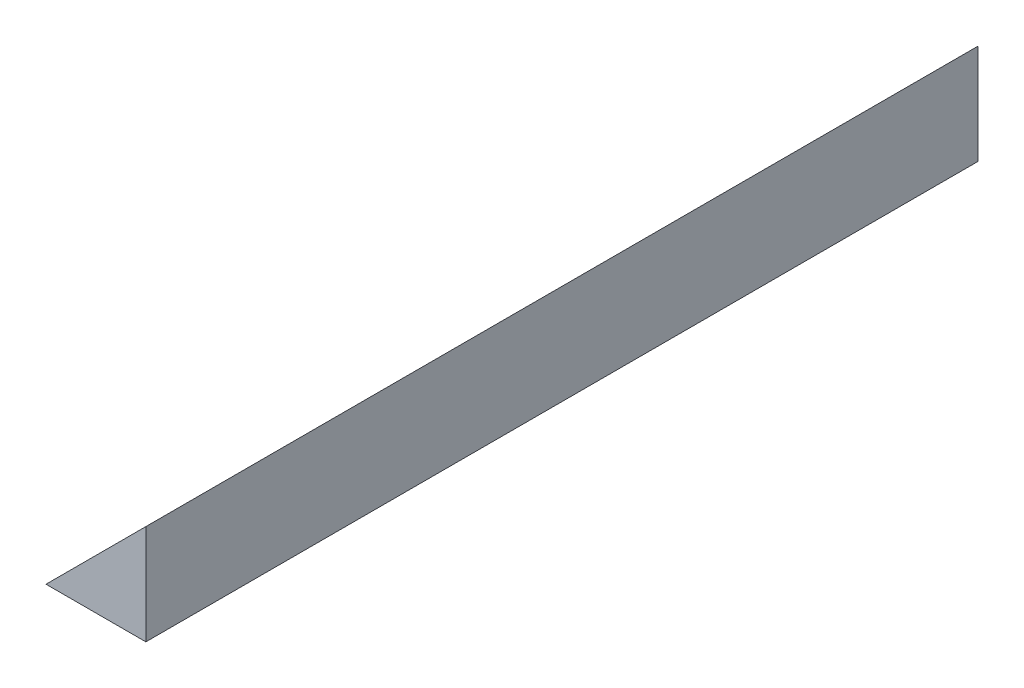
ISO-10303-21;
HEADER;
FILE_DESCRIPTION(('STEP AP214'),'2;1');
FILE_NAME('part.step','',(''),(''),'','','');
FILE_SCHEMA(('AUTOMOTIVE_DESIGN { 1 0 10303 214 1 1 1 1 }'));
ENDSEC;
DATA;
#1=APPLICATION_CONTEXT('core data for automotive mechanical design processes');
#2=APPLICATION_PROTOCOL_DEFINITION('international standard','automotive_design',2000,#1);
#3=PRODUCT_CONTEXT('',#1,'mechanical');
#4=PRODUCT('Part','Part','',(#3));
#5=PRODUCT_RELATED_PRODUCT_CATEGORY('part','',(#4));
#6=PRODUCT_DEFINITION_FORMATION('','',#4);
#7=PRODUCT_DEFINITION_CONTEXT('part definition',#1,'design');
#8=PRODUCT_DEFINITION('design','',#6,#7);
#9=PRODUCT_DEFINITION_SHAPE('','',#8);
#10=(LENGTH_UNIT() NAMED_UNIT(*) SI_UNIT(.MILLI.,.METRE.));
#11=(NAMED_UNIT(*) PLANE_ANGLE_UNIT() SI_UNIT($,.RADIAN.));
#12=(NAMED_UNIT(*) SI_UNIT($,.STERADIAN.) SOLID_ANGLE_UNIT());
#13=UNCERTAINTY_MEASURE_WITH_UNIT(LENGTH_MEASURE(1.E-05),#10,'distance_accuracy_value','');
#14=(GEOMETRIC_REPRESENTATION_CONTEXT(3) GLOBAL_UNCERTAINTY_ASSIGNED_CONTEXT((#13)) GLOBAL_UNIT_ASSIGNED_CONTEXT((#10,
#11,#12)) REPRESENTATION_CONTEXT('',''));
#15=CARTESIAN_POINT('',(0.,0.,0.));
#16=DIRECTION('',(0.,0.,1.));
#17=DIRECTION('',(1.,0.,0.));
#18=AXIS2_PLACEMENT_3D('',#15,#16,#17);
#19=CARTESIAN_POINT('',(0.,6.,50.));
#20=DIRECTION('',(0.707106781186548,-0.707106781186548,0.));
#21=DIRECTION('',(0.707106781186548,0.707106781186548,0.));
#22=AXIS2_PLACEMENT_3D('',#19,#20,#21);
#23=PLANE('',#22);
#24=DIRECTION('',(-0.707106781186548,-0.707106781186548,0.));
#25=VECTOR('',#24,1.);
#26=CARTESIAN_POINT('',(0.,6.,0.));
#27=LINE('',#26,#25);
#28=CARTESIAN_POINT('',(0.,6.,0.));
#29=VERTEX_POINT('',#28);
#30=CARTESIAN_POINT('',(-6.,0.,0.));
#31=VERTEX_POINT('',#30);
#32=EDGE_CURVE('E83',#29,#31,#27,.T.);
#33=ORIENTED_EDGE('',*,*,#32,.T.);
#34=DIRECTION('',(0.,0.,-1.));
#35=VECTOR('',#34,1.);
#36=CARTESIAN_POINT('',(-6.,0.,50.));
#37=LINE('',#36,#35);
#38=CARTESIAN_POINT('',(-6.,0.,50.));
#39=VERTEX_POINT('',#38);
#40=EDGE_CURVE('E11',#39,#31,#37,.T.);
#41=ORIENTED_EDGE('',*,*,#40,.F.);
#42=DIRECTION('',(-0.707106781186548,-0.707106781186548,0.));
#43=VECTOR('',#42,1.);
#44=CARTESIAN_POINT('',(0.,6.,50.));
#45=LINE('',#44,#43);
#46=CARTESIAN_POINT('',(0.,6.,50.));
#47=VERTEX_POINT('',#46);
#48=EDGE_CURVE('E76',#47,#39,#45,.T.);
#49=ORIENTED_EDGE('',*,*,#48,.F.);
#50=DIRECTION('',(0.,0.,-1.));
#51=VECTOR('',#50,1.);
#52=CARTESIAN_POINT('',(0.,6.,50.));
#53=LINE('',#52,#51);
#54=EDGE_CURVE('E84',#47,#29,#53,.T.);
#55=ORIENTED_EDGE('',*,*,#54,.T.);
#56=EDGE_LOOP('',(#33,#41,#49,#55));
#57=FACE_BOUND('',#56,.T.);
#58=ADVANCED_FACE('F36',(#57),#23,.F.);
#59=CARTESIAN_POINT('',(-6.,0.,50.));
#60=DIRECTION('',(0.,1.,0.));
#61=DIRECTION('',(0.,0.,1.));
#62=AXIS2_PLACEMENT_3D('',#59,#60,#61);
#63=PLANE('',#62);
#64=DIRECTION('',(1.,0.,0.));
#65=VECTOR('',#64,1.);
#66=CARTESIAN_POINT('',(-6.,0.,0.));
#67=LINE('',#66,#65);
#68=CARTESIAN_POINT('',(0.,0.,0.));
#69=VERTEX_POINT('',#68);
#70=EDGE_CURVE('E64',#31,#69,#67,.T.);
#71=ORIENTED_EDGE('',*,*,#70,.T.);
#72=DIRECTION('',(0.,0.,-1.));
#73=VECTOR('',#72,1.);
#74=CARTESIAN_POINT('',(0.,0.,50.));
#75=LINE('',#74,#73);
#76=CARTESIAN_POINT('',(0.,0.,50.));
#77=VERTEX_POINT('',#76);
#78=EDGE_CURVE('E44',#77,#69,#75,.T.);
#79=ORIENTED_EDGE('',*,*,#78,.F.);
#80=DIRECTION('',(1.,0.,0.));
#81=VECTOR('',#80,1.);
#82=CARTESIAN_POINT('',(-6.,0.,50.));
#83=LINE('',#82,#81);
#84=EDGE_CURVE('E72',#39,#77,#83,.T.);
#85=ORIENTED_EDGE('',*,*,#84,.F.);
#86=ORIENTED_EDGE('',*,*,#40,.T.);
#87=EDGE_LOOP('',(#71,#79,#85,#86));
#88=FACE_BOUND('',#87,.T.);
#89=ADVANCED_FACE('F73',(#88),#63,.F.);
#90=CARTESIAN_POINT('',(0.,0.,50.));
#91=DIRECTION('',(-1.,0.,0.));
#92=DIRECTION('',(0.,0.,1.));
#93=AXIS2_PLACEMENT_3D('',#90,#91,#92);
#94=PLANE('',#93);
#95=DIRECTION('',(0.,1.,0.));
#96=VECTOR('',#95,1.);
#97=CARTESIAN_POINT('',(0.,0.,0.));
#98=LINE('',#97,#96);
#99=EDGE_CURVE('E69',#69,#29,#98,.T.);
#100=ORIENTED_EDGE('',*,*,#99,.T.);
#101=ORIENTED_EDGE('',*,*,#54,.F.);
#102=DIRECTION('',(0.,1.,0.));
#103=VECTOR('',#102,1.);
#104=CARTESIAN_POINT('',(0.,0.,50.));
#105=LINE('',#104,#103);
#106=EDGE_CURVE('E52',#77,#47,#105,.T.);
#107=ORIENTED_EDGE('',*,*,#106,.F.);
#108=ORIENTED_EDGE('',*,*,#78,.T.);
#109=EDGE_LOOP('',(#100,#101,#107,#108));
#110=FACE_BOUND('',#109,.T.);
#111=ADVANCED_FACE('F94',(#110),#94,.F.);
#112=CARTESIAN_POINT('',(-6.,0.,50.));
#113=DIRECTION('',(0.,0.,1.));
#114=DIRECTION('',(1.,0.,0.));
#115=AXIS2_PLACEMENT_3D('',#112,#113,#114);
#116=PLANE('',#115);
#117=ORIENTED_EDGE('',*,*,#48,.T.);
#118=ORIENTED_EDGE('',*,*,#84,.T.);
#119=ORIENTED_EDGE('',*,*,#106,.T.);
#120=EDGE_LOOP('',(#117,#118,#119));
#121=FACE_BOUND('',#120,.T.);
#122=ADVANCED_FACE('F79',(#121),#116,.T.);
#123=CARTESIAN_POINT('',(-6.,0.,0.));
#124=DIRECTION('',(0.,0.,1.));
#125=DIRECTION('',(1.,0.,0.));
#126=AXIS2_PLACEMENT_3D('',#123,#124,#125);
#127=PLANE('',#126);
#128=ORIENTED_EDGE('',*,*,#32,.F.);
#129=ORIENTED_EDGE('',*,*,#99,.F.);
#130=ORIENTED_EDGE('',*,*,#70,.F.);
#131=EDGE_LOOP('',(#128,#129,#130));
#132=FACE_BOUND('',#131,.T.);
#133=ADVANCED_FACE('F95',(#132),#127,.F.);
#134=CLOSED_SHELL('',(#58,#89,#111,#122,#133));
#135=MANIFOLD_SOLID_BREP('B2',#134);
#136=ADVANCED_BREP_SHAPE_REPRESENTATION('',(#18,#135),#14);
#137=SHAPE_DEFINITION_REPRESENTATION(#9,#136);
ENDSEC;
END-ISO-10303-21;
